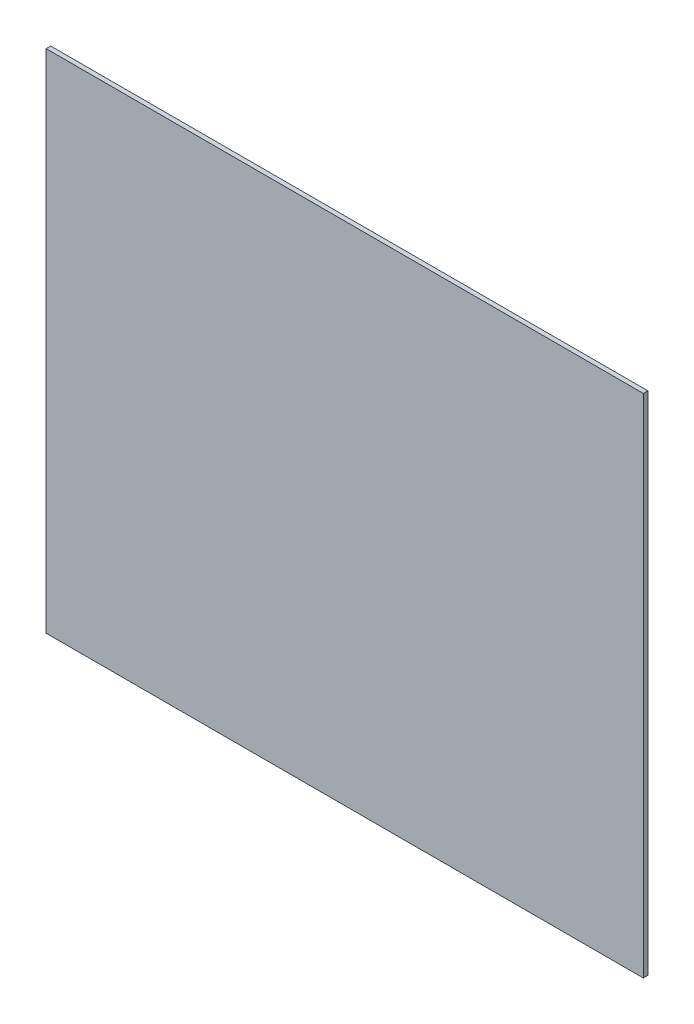
ISO-10303-21;
HEADER;
FILE_DESCRIPTION(('STEP AP214'),'2;1');
FILE_NAME('part.step','',(''),(''),'','','');
FILE_SCHEMA(('AUTOMOTIVE_DESIGN { 1 0 10303 214 1 1 1 1 }'));
ENDSEC;
DATA;
#1=APPLICATION_CONTEXT('core data for automotive mechanical design processes');
#2=APPLICATION_PROTOCOL_DEFINITION('international standard','automotive_design',2000,#1);
#3=PRODUCT_CONTEXT('',#1,'mechanical');
#4=PRODUCT('Part','Part','',(#3));
#5=PRODUCT_RELATED_PRODUCT_CATEGORY('part','',(#4));
#6=PRODUCT_DEFINITION_FORMATION('','',#4);
#7=PRODUCT_DEFINITION_CONTEXT('part definition',#1,'design');
#8=PRODUCT_DEFINITION('design','',#6,#7);
#9=PRODUCT_DEFINITION_SHAPE('','',#8);
#10=(LENGTH_UNIT() NAMED_UNIT(*) SI_UNIT(.MILLI.,.METRE.));
#11=(NAMED_UNIT(*) PLANE_ANGLE_UNIT() SI_UNIT($,.RADIAN.));
#12=(NAMED_UNIT(*) SI_UNIT($,.STERADIAN.) SOLID_ANGLE_UNIT());
#13=UNCERTAINTY_MEASURE_WITH_UNIT(LENGTH_MEASURE(1.E-05),#10,'distance_accuracy_value','');
#14=(GEOMETRIC_REPRESENTATION_CONTEXT(3) GLOBAL_UNCERTAINTY_ASSIGNED_CONTEXT((#13)) GLOBAL_UNIT_ASSIGNED_CONTEXT((#10,
#11,#12)) REPRESENTATION_CONTEXT('',''));
#15=CARTESIAN_POINT('',(0.,0.,0.));
#16=DIRECTION('',(0.,0.,1.));
#17=DIRECTION('',(1.,0.,0.));
#18=AXIS2_PLACEMENT_3D('',#15,#16,#17);
#19=CARTESIAN_POINT('',(197.,167.,0.));
#20=DIRECTION('',(0.,0.,1.));
#21=DIRECTION('',(1.,0.,0.));
#22=AXIS2_PLACEMENT_3D('',#19,#20,#21);
#23=PLANE('',#22);
#24=DIRECTION('',(0.,1.,0.));
#25=VECTOR('',#24,1.);
#26=CARTESIAN_POINT('',(0.,334.,0.));
#27=LINE('',#26,#25);
#28=CARTESIAN_POINT('',(0.,334.,0.));
#29=VERTEX_POINT('',#28);
#30=CARTESIAN_POINT('',(0.,0.,0.));
#31=VERTEX_POINT('',#30);
#32=EDGE_CURVE('E87',#29,#31,#27,.F.);
#33=ORIENTED_EDGE('',*,*,#32,.F.);
#34=DIRECTION('',(1.,0.,0.));
#35=VECTOR('',#34,1.);
#36=CARTESIAN_POINT('',(394.,334.,0.));
#37=LINE('',#36,#35);
#38=CARTESIAN_POINT('',(394.,334.,0.));
#39=VERTEX_POINT('',#38);
#40=EDGE_CURVE('E56',#39,#29,#37,.F.);
#41=ORIENTED_EDGE('',*,*,#40,.F.);
#42=DIRECTION('',(0.,1.,0.));
#43=VECTOR('',#42,1.);
#44=CARTESIAN_POINT('',(394.,0.,0.));
#45=LINE('',#44,#43);
#46=CARTESIAN_POINT('',(394.,0.,0.));
#47=VERTEX_POINT('',#46);
#48=EDGE_CURVE('E58',#47,#39,#45,.T.);
#49=ORIENTED_EDGE('',*,*,#48,.F.);
#50=DIRECTION('',(1.,0.,0.));
#51=VECTOR('',#50,1.);
#52=CARTESIAN_POINT('',(0.,0.,0.));
#53=LINE('',#52,#51);
#54=EDGE_CURVE('E20',#31,#47,#53,.T.);
#55=ORIENTED_EDGE('',*,*,#54,.F.);
#56=EDGE_LOOP('',(#33,#41,#49,#55));
#57=FACE_BOUND('',#56,.T.);
#58=ADVANCED_FACE('F17',(#57),#23,.F.);
#59=CARTESIAN_POINT('',(0.,0.,0.));
#60=DIRECTION('',(0.,-1.,0.));
#61=DIRECTION('',(0.,0.,-1.));
#62=AXIS2_PLACEMENT_3D('',#59,#60,#61);
#63=PLANE('',#62);
#64=DIRECTION('',(1.,0.,0.));
#65=VECTOR('',#64,1.);
#66=CARTESIAN_POINT('',(197.,0.,3.));
#67=LINE('',#66,#65);
#68=CARTESIAN_POINT('',(0.,0.,3.));
#69=VERTEX_POINT('',#68);
#70=CARTESIAN_POINT('',(394.,0.,3.));
#71=VERTEX_POINT('',#70);
#72=EDGE_CURVE('E93',#69,#71,#67,.T.);
#73=ORIENTED_EDGE('',*,*,#72,.F.);
#74=DIRECTION('',(0.,0.,1.));
#75=VECTOR('',#74,1.);
#76=CARTESIAN_POINT('',(0.,0.,0.));
#77=LINE('',#76,#75);
#78=EDGE_CURVE('E70',#31,#69,#77,.T.);
#79=ORIENTED_EDGE('',*,*,#78,.F.);
#80=ORIENTED_EDGE('',*,*,#54,.T.);
#81=DIRECTION('',(0.,0.,-1.));
#82=VECTOR('',#81,1.);
#83=CARTESIAN_POINT('',(394.,0.,0.));
#84=LINE('',#83,#82);
#85=EDGE_CURVE('E65',#71,#47,#84,.T.);
#86=ORIENTED_EDGE('',*,*,#85,.F.);
#87=EDGE_LOOP('',(#73,#79,#80,#86));
#88=FACE_BOUND('',#87,.T.);
#89=ADVANCED_FACE('F67',(#88),#63,.T.);
#90=CARTESIAN_POINT('',(394.,0.,0.));
#91=DIRECTION('',(1.,0.,0.));
#92=DIRECTION('',(0.,0.,-1.));
#93=AXIS2_PLACEMENT_3D('',#90,#91,#92);
#94=PLANE('',#93);
#95=DIRECTION('',(0.,1.,0.));
#96=VECTOR('',#95,1.);
#97=CARTESIAN_POINT('',(394.,167.,3.));
#98=LINE('',#97,#96);
#99=CARTESIAN_POINT('',(394.,334.,3.));
#100=VERTEX_POINT('',#99);
#101=EDGE_CURVE('E75',#71,#100,#98,.T.);
#102=ORIENTED_EDGE('',*,*,#101,.F.);
#103=ORIENTED_EDGE('',*,*,#85,.T.);
#104=ORIENTED_EDGE('',*,*,#48,.T.);
#105=DIRECTION('',(0.,0.,1.));
#106=VECTOR('',#105,1.);
#107=CARTESIAN_POINT('',(394.,334.,0.));
#108=LINE('',#107,#106);
#109=EDGE_CURVE('E82',#100,#39,#108,.F.);
#110=ORIENTED_EDGE('',*,*,#109,.F.);
#111=EDGE_LOOP('',(#102,#103,#104,#110));
#112=FACE_BOUND('',#111,.T.);
#113=ADVANCED_FACE('F73',(#112),#94,.T.);
#114=CARTESIAN_POINT('',(394.,334.,0.));
#115=DIRECTION('',(0.,1.,0.));
#116=DIRECTION('',(0.,0.,1.));
#117=AXIS2_PLACEMENT_3D('',#114,#115,#116);
#118=PLANE('',#117);
#119=DIRECTION('',(1.,0.,0.));
#120=VECTOR('',#119,1.);
#121=CARTESIAN_POINT('',(197.,334.,3.));
#122=LINE('',#121,#120);
#123=CARTESIAN_POINT('',(0.,334.,3.));
#124=VERTEX_POINT('',#123);
#125=EDGE_CURVE('E27',#100,#124,#122,.F.);
#126=ORIENTED_EDGE('',*,*,#125,.F.);
#127=ORIENTED_EDGE('',*,*,#109,.T.);
#128=ORIENTED_EDGE('',*,*,#40,.T.);
#129=DIRECTION('',(0.,0.,1.));
#130=VECTOR('',#129,1.);
#131=CARTESIAN_POINT('',(0.,334.,0.));
#132=LINE('',#131,#130);
#133=EDGE_CURVE('E36',#124,#29,#132,.F.);
#134=ORIENTED_EDGE('',*,*,#133,.F.);
#135=EDGE_LOOP('',(#126,#127,#128,#134));
#136=FACE_BOUND('',#135,.T.);
#137=ADVANCED_FACE('F102',(#136),#118,.T.);
#138=CARTESIAN_POINT('',(0.,334.,0.));
#139=DIRECTION('',(-1.,0.,0.));
#140=DIRECTION('',(0.,0.,1.));
#141=AXIS2_PLACEMENT_3D('',#138,#139,#140);
#142=PLANE('',#141);
#143=DIRECTION('',(0.,1.,0.));
#144=VECTOR('',#143,1.);
#145=CARTESIAN_POINT('',(0.,167.,3.));
#146=LINE('',#145,#144);
#147=EDGE_CURVE('E11',#124,#69,#146,.F.);
#148=ORIENTED_EDGE('',*,*,#147,.F.);
#149=ORIENTED_EDGE('',*,*,#133,.T.);
#150=ORIENTED_EDGE('',*,*,#32,.T.);
#151=ORIENTED_EDGE('',*,*,#78,.T.);
#152=EDGE_LOOP('',(#148,#149,#150,#151));
#153=FACE_BOUND('',#152,.T.);
#154=ADVANCED_FACE('F104',(#153),#142,.T.);
#155=CARTESIAN_POINT('',(197.,167.,3.));
#156=DIRECTION('',(0.,0.,1.));
#157=DIRECTION('',(1.,0.,0.));
#158=AXIS2_PLACEMENT_3D('',#155,#156,#157);
#159=PLANE('',#158);
#160=ORIENTED_EDGE('',*,*,#125,.T.);
#161=ORIENTED_EDGE('',*,*,#147,.T.);
#162=ORIENTED_EDGE('',*,*,#72,.T.);
#163=ORIENTED_EDGE('',*,*,#101,.T.);
#164=EDGE_LOOP('',(#160,#161,#162,#163));
#165=FACE_BOUND('',#164,.T.);
#166=ADVANCED_FACE('F101',(#165),#159,.T.);
#167=CLOSED_SHELL('',(#58,#89,#113,#137,#154,#166));
#168=MANIFOLD_SOLID_BREP('B1',#167);
#169=ADVANCED_BREP_SHAPE_REPRESENTATION('',(#18,#168),#14);
#170=SHAPE_DEFINITION_REPRESENTATION(#9,#169);
ENDSEC;
END-ISO-10303-21;
